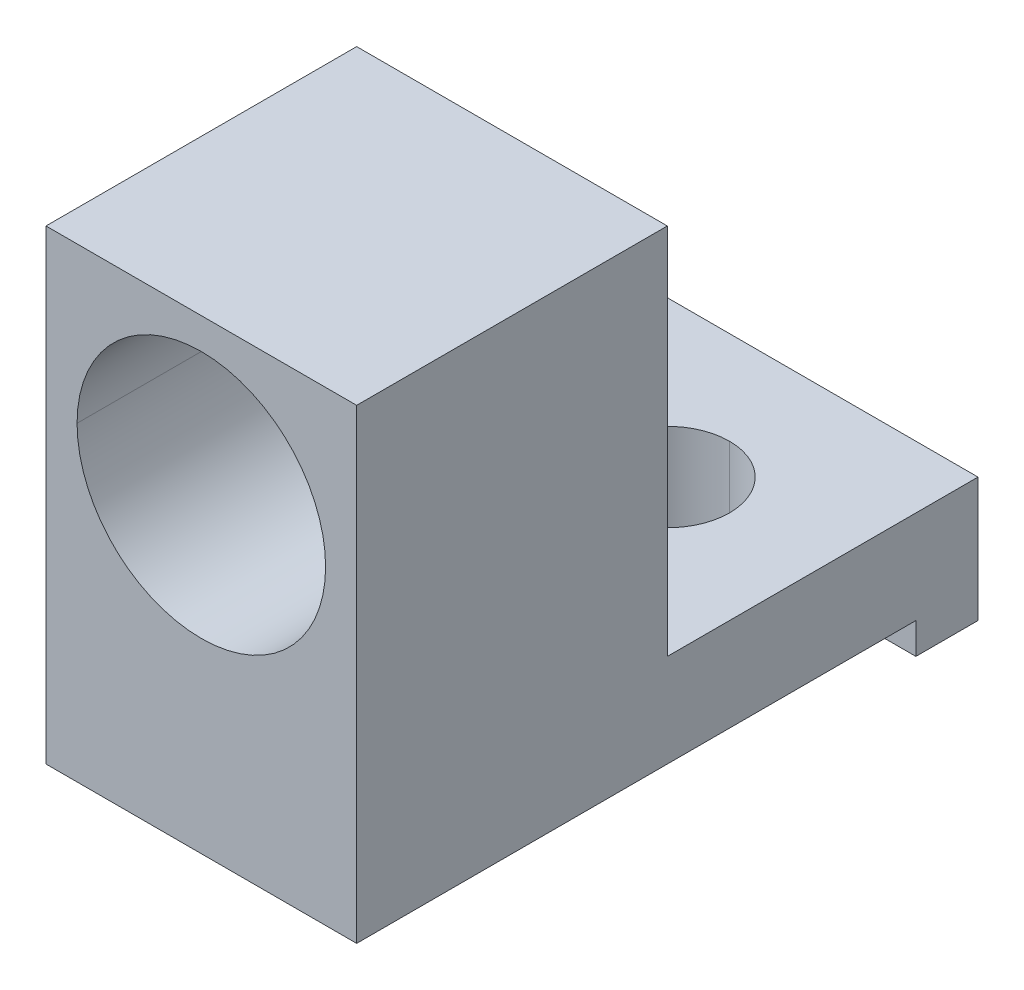
ISO-10303-21;
HEADER;
FILE_DESCRIPTION(('STEP AP214'),'2;1');
FILE_NAME('part.step','',(''),(''),'','','');
FILE_SCHEMA(('AUTOMOTIVE_DESIGN { 1 0 10303 214 1 1 1 1 }'));
ENDSEC;
DATA;
#1=APPLICATION_CONTEXT('core data for automotive mechanical design processes');
#2=APPLICATION_PROTOCOL_DEFINITION('international standard','automotive_design',2000,#1);
#3=PRODUCT_CONTEXT('',#1,'mechanical');
#4=PRODUCT('Part','Part','',(#3));
#5=PRODUCT_RELATED_PRODUCT_CATEGORY('part','',(#4));
#6=PRODUCT_DEFINITION_FORMATION('','',#4);
#7=PRODUCT_DEFINITION_CONTEXT('part definition',#1,'design');
#8=PRODUCT_DEFINITION('design','',#6,#7);
#9=PRODUCT_DEFINITION_SHAPE('','',#8);
#10=(LENGTH_UNIT() NAMED_UNIT(*) SI_UNIT(.MILLI.,.METRE.));
#11=(NAMED_UNIT(*) PLANE_ANGLE_UNIT() SI_UNIT($,.RADIAN.));
#12=(NAMED_UNIT(*) SI_UNIT($,.STERADIAN.) SOLID_ANGLE_UNIT());
#13=UNCERTAINTY_MEASURE_WITH_UNIT(LENGTH_MEASURE(1.E-05),#10,'distance_accuracy_value','');
#14=(GEOMETRIC_REPRESENTATION_CONTEXT(3) GLOBAL_UNCERTAINTY_ASSIGNED_CONTEXT((#13)) GLOBAL_UNIT_ASSIGNED_CONTEXT((#10,
#11,#12)) REPRESENTATION_CONTEXT('',''));
#15=CARTESIAN_POINT('',(0.,0.,0.));
#16=DIRECTION('',(0.,0.,1.));
#17=DIRECTION('',(1.,0.,0.));
#18=AXIS2_PLACEMENT_3D('',#15,#16,#17);
#19=CARTESIAN_POINT('',(5.,5.,-20.));
#20=DIRECTION('',(1.,0.,0.));
#21=DIRECTION('',(0.,1.,0.));
#22=AXIS2_PLACEMENT_3D('',#19,#20,#21);
#23=PLANE('',#22);
#24=DIRECTION('',(0.,1.,0.));
#25=VECTOR('',#24,1.);
#26=CARTESIAN_POINT('',(5.,-10.,-18.));
#27=LINE('',#26,#25);
#28=CARTESIAN_POINT('',(5.,-11.,-18.));
#29=VERTEX_POINT('',#28);
#30=CARTESIAN_POINT('',(5.,-10.,-18.));
#31=VERTEX_POINT('',#30);
#32=EDGE_CURVE('E175',#29,#31,#27,.T.);
#33=ORIENTED_EDGE('',*,*,#32,.F.);
#34=DIRECTION('',(0.,0.,1.));
#35=VECTOR('',#34,1.);
#36=CARTESIAN_POINT('',(5.,-11.,-18.));
#37=LINE('',#36,#35);
#38=CARTESIAN_POINT('',(5.,-11.,-20.));
#39=VERTEX_POINT('',#38);
#40=EDGE_CURVE('E42',#39,#29,#37,.T.);
#41=ORIENTED_EDGE('',*,*,#40,.F.);
#42=DIRECTION('',(0.,1.,0.));
#43=VECTOR('',#42,1.);
#44=CARTESIAN_POINT('',(5.,5.,-20.));
#45=LINE('',#44,#43);
#46=CARTESIAN_POINT('',(5.,-7.,-20.));
#47=VERTEX_POINT('',#46);
#48=EDGE_CURVE('E11',#39,#47,#45,.T.);
#49=ORIENTED_EDGE('',*,*,#48,.T.);
#50=DIRECTION('',(0.,0.,-1.));
#51=VECTOR('',#50,1.);
#52=CARTESIAN_POINT('',(5.,-7.,-20.));
#53=LINE('',#52,#51);
#54=CARTESIAN_POINT('',(5.,-7.,-10.));
#55=VERTEX_POINT('',#54);
#56=EDGE_CURVE('E231',#55,#47,#53,.T.);
#57=ORIENTED_EDGE('',*,*,#56,.F.);
#58=DIRECTION('',(0.,-1.,0.));
#59=VECTOR('',#58,1.);
#60=CARTESIAN_POINT('',(5.,5.,-10.));
#61=LINE('',#60,#59);
#62=CARTESIAN_POINT('',(5.,5.,-10.));
#63=VERTEX_POINT('',#62);
#64=EDGE_CURVE('E255',#63,#55,#61,.T.);
#65=ORIENTED_EDGE('',*,*,#64,.F.);
#66=DIRECTION('',(0.,0.,1.));
#67=VECTOR('',#66,1.);
#68=CARTESIAN_POINT('',(5.,5.,-20.));
#69=LINE('',#68,#67);
#70=CARTESIAN_POINT('',(5.,5.,0.));
#71=VERTEX_POINT('',#70);
#72=EDGE_CURVE('E27',#63,#71,#69,.T.);
#73=ORIENTED_EDGE('',*,*,#72,.T.);
#74=DIRECTION('',(0.,1.,0.));
#75=VECTOR('',#74,1.);
#76=CARTESIAN_POINT('',(5.,5.,0.));
#77=LINE('',#76,#75);
#78=CARTESIAN_POINT('',(5.,-10.,0.));
#79=VERTEX_POINT('',#78);
#80=EDGE_CURVE('E208',#79,#71,#77,.T.);
#81=ORIENTED_EDGE('',*,*,#80,.F.);
#82=DIRECTION('',(0.,0.,1.));
#83=VECTOR('',#82,1.);
#84=CARTESIAN_POINT('',(5.,-10.,0.));
#85=LINE('',#84,#83);
#86=EDGE_CURVE('E226',#31,#79,#85,.T.);
#87=ORIENTED_EDGE('',*,*,#86,.F.);
#88=EDGE_LOOP('',(#33,#41,#49,#57,#65,#73,#81,#87));
#89=FACE_BOUND('',#88,.T.);
#90=ADVANCED_FACE('F16',(#89),#23,.T.);
#91=CARTESIAN_POINT('',(-5.,5.,-20.));
#92=DIRECTION('',(-1.,0.,0.));
#93=DIRECTION('',(0.,1.,0.));
#94=AXIS2_PLACEMENT_3D('',#91,#92,#93);
#95=PLANE('',#94);
#96=DIRECTION('',(0.,-1.,0.));
#97=VECTOR('',#96,1.);
#98=CARTESIAN_POINT('',(-5.,5.,-20.));
#99=LINE('',#98,#97);
#100=CARTESIAN_POINT('',(-5.,-7.,-20.));
#101=VERTEX_POINT('',#100);
#102=CARTESIAN_POINT('',(-5.,-11.,-20.));
#103=VERTEX_POINT('',#102);
#104=EDGE_CURVE('E236',#101,#103,#99,.T.);
#105=ORIENTED_EDGE('',*,*,#104,.T.);
#106=DIRECTION('',(0.,0.,-1.));
#107=VECTOR('',#106,1.);
#108=CARTESIAN_POINT('',(-5.,-11.,-18.));
#109=LINE('',#108,#107);
#110=CARTESIAN_POINT('',(-5.,-11.,-18.));
#111=VERTEX_POINT('',#110);
#112=EDGE_CURVE('E180',#111,#103,#109,.T.);
#113=ORIENTED_EDGE('',*,*,#112,.F.);
#114=DIRECTION('',(0.,1.,0.));
#115=VECTOR('',#114,1.);
#116=CARTESIAN_POINT('',(-5.,-10.,-18.));
#117=LINE('',#116,#115);
#118=CARTESIAN_POINT('',(-5.,-10.,-18.));
#119=VERTEX_POINT('',#118);
#120=EDGE_CURVE('E240',#111,#119,#117,.T.);
#121=ORIENTED_EDGE('',*,*,#120,.T.);
#122=DIRECTION('',(0.,0.,1.));
#123=VECTOR('',#122,1.);
#124=CARTESIAN_POINT('',(-5.,-10.,0.));
#125=LINE('',#124,#123);
#126=CARTESIAN_POINT('',(-5.,-10.,0.));
#127=VERTEX_POINT('',#126);
#128=EDGE_CURVE('E221',#119,#127,#125,.T.);
#129=ORIENTED_EDGE('',*,*,#128,.T.);
#130=DIRECTION('',(0.,-1.,0.));
#131=VECTOR('',#130,1.);
#132=CARTESIAN_POINT('',(-5.,5.,0.));
#133=LINE('',#132,#131);
#134=CARTESIAN_POINT('',(-5.,5.,0.));
#135=VERTEX_POINT('',#134);
#136=EDGE_CURVE('E209',#135,#127,#133,.T.);
#137=ORIENTED_EDGE('',*,*,#136,.F.);
#138=DIRECTION('',(0.,0.,1.));
#139=VECTOR('',#138,1.);
#140=CARTESIAN_POINT('',(-5.,5.,-20.));
#141=LINE('',#140,#139);
#142=CARTESIAN_POINT('',(-5.,5.,-10.));
#143=VERTEX_POINT('',#142);
#144=EDGE_CURVE('E193',#143,#135,#141,.T.);
#145=ORIENTED_EDGE('',*,*,#144,.F.);
#146=DIRECTION('',(0.,-1.,0.));
#147=VECTOR('',#146,1.);
#148=CARTESIAN_POINT('',(-5.,5.,-10.));
#149=LINE('',#148,#147);
#150=CARTESIAN_POINT('',(-5.,-7.,-10.));
#151=VERTEX_POINT('',#150);
#152=EDGE_CURVE('E217',#143,#151,#149,.T.);
#153=ORIENTED_EDGE('',*,*,#152,.T.);
#154=DIRECTION('',(0.,0.,-1.));
#155=VECTOR('',#154,1.);
#156=CARTESIAN_POINT('',(-5.,-7.,-20.));
#157=LINE('',#156,#155);
#158=EDGE_CURVE('E222',#151,#101,#157,.T.);
#159=ORIENTED_EDGE('',*,*,#158,.T.);
#160=EDGE_LOOP('',(#105,#113,#121,#129,#137,#145,#153,#159));
#161=FACE_BOUND('',#160,.T.);
#162=ADVANCED_FACE('F286',(#161),#95,.T.);
#163=CARTESIAN_POINT('',(0.,0.,-20.));
#164=DIRECTION('',(0.,0.,1.));
#165=DIRECTION('',(1.,0.,0.));
#166=AXIS2_PLACEMENT_3D('',#163,#164,#165);
#167=PLANE('',#166);
#168=DIRECTION('',(1.,0.,0.));
#169=VECTOR('',#168,1.);
#170=CARTESIAN_POINT('',(-5.,-11.,-20.));
#171=LINE('',#170,#169);
#172=EDGE_CURVE('E189',#103,#39,#171,.T.);
#173=ORIENTED_EDGE('',*,*,#172,.F.);
#174=ORIENTED_EDGE('',*,*,#104,.F.);
#175=DIRECTION('',(1.,0.,0.));
#176=VECTOR('',#175,1.);
#177=CARTESIAN_POINT('',(-5.,-7.,-20.));
#178=LINE('',#177,#176);
#179=EDGE_CURVE('E244',#101,#47,#178,.T.);
#180=ORIENTED_EDGE('',*,*,#179,.T.);
#181=ORIENTED_EDGE('',*,*,#48,.F.);
#182=EDGE_LOOP('',(#173,#174,#180,#181));
#183=FACE_BOUND('',#182,.T.);
#184=ADVANCED_FACE('F291',(#183),#167,.F.);
#185=CARTESIAN_POINT('',(-5.,-10.,-18.));
#186=DIRECTION('',(0.,0.,-1.));
#187=DIRECTION('',(0.,-1.,0.));
#188=AXIS2_PLACEMENT_3D('',#185,#186,#187);
#189=PLANE('',#188);
#190=DIRECTION('',(-1.,0.,0.));
#191=VECTOR('',#190,1.);
#192=CARTESIAN_POINT('',(-5.,-11.,-18.));
#193=LINE('',#192,#191);
#194=EDGE_CURVE('E216',#29,#111,#193,.T.);
#195=ORIENTED_EDGE('',*,*,#194,.F.);
#196=ORIENTED_EDGE('',*,*,#32,.T.);
#197=DIRECTION('',(1.,0.,0.));
#198=VECTOR('',#197,1.);
#199=CARTESIAN_POINT('',(-5.,-10.,-18.));
#200=LINE('',#199,#198);
#201=EDGE_CURVE('E250',#119,#31,#200,.T.);
#202=ORIENTED_EDGE('',*,*,#201,.F.);
#203=ORIENTED_EDGE('',*,*,#120,.F.);
#204=EDGE_LOOP('',(#195,#196,#202,#203));
#205=FACE_BOUND('',#204,.T.);
#206=ADVANCED_FACE('F309',(#205),#189,.F.);
#207=CARTESIAN_POINT('',(0.,-12.,-15.));
#208=DIRECTION('',(0.,1.,0.));
#209=DIRECTION('',(0.,0.,1.));
#210=AXIS2_PLACEMENT_3D('',#207,#208,#209);
#211=CYLINDRICAL_SURFACE('',#210,2.);
#212=CARTESIAN_POINT('',(0.,-10.,-15.));
#213=DIRECTION('',(0.,1.,0.));
#214=DIRECTION('',(0.,0.,1.));
#215=AXIS2_PLACEMENT_3D('',#212,#213,#214);
#216=CIRCLE('',#215,2.);
#217=CARTESIAN_POINT('',(0.,-10.,-17.));
#218=VERTEX_POINT('',#217);
#219=CARTESIAN_POINT('',(0.,-10.,-13.));
#220=VERTEX_POINT('',#219);
#221=EDGE_CURVE('E170',#218,#220,#216,.T.);
#222=ORIENTED_EDGE('',*,*,#221,.F.);
#223=DIRECTION('',(0.,1.,0.));
#224=VECTOR('',#223,1.);
#225=CARTESIAN_POINT('',(0.,-12.,-17.));
#226=LINE('',#225,#224);
#227=CARTESIAN_POINT('',(0.,-7.,-17.));
#228=VERTEX_POINT('',#227);
#229=EDGE_CURVE('E164',#218,#228,#226,.T.);
#230=ORIENTED_EDGE('',*,*,#229,.T.);
#231=CARTESIAN_POINT('',(0.,-7.,-15.));
#232=DIRECTION('',(0.,1.,0.));
#233=DIRECTION('',(0.,0.,1.));
#234=AXIS2_PLACEMENT_3D('',#231,#232,#233);
#235=CIRCLE('',#234,2.);
#236=CARTESIAN_POINT('',(0.,-7.,-13.));
#237=VERTEX_POINT('',#236);
#238=EDGE_CURVE('E157',#228,#237,#235,.T.);
#239=ORIENTED_EDGE('',*,*,#238,.T.);
#240=DIRECTION('',(0.,1.,0.));
#241=VECTOR('',#240,1.);
#242=CARTESIAN_POINT('',(0.,-12.,-13.));
#243=LINE('',#242,#241);
#244=EDGE_CURVE('E178',#220,#237,#243,.T.);
#245=ORIENTED_EDGE('',*,*,#244,.F.);
#246=EDGE_LOOP('',(#222,#230,#239,#245));
#247=FACE_BOUND('',#246,.T.);
#248=ADVANCED_FACE('F168',(#247),#211,.F.);
#249=CARTESIAN_POINT('',(0.,0.,-20.));
#250=DIRECTION('',(0.,0.,1.));
#251=DIRECTION('',(1.,0.,0.));
#252=AXIS2_PLACEMENT_3D('',#249,#250,#251);
#253=CYLINDRICAL_SURFACE('',#252,3.);
#254=CARTESIAN_POINT('',(0.,0.,-10.));
#255=DIRECTION('',(0.,0.,1.));
#256=DIRECTION('',(0.,-1.,0.));
#257=AXIS2_PLACEMENT_3D('',#254,#255,#256);
#258=CIRCLE('',#257,3.);
#259=CARTESIAN_POINT('',(-3.,0.,-10.));
#260=VERTEX_POINT('',#259);
#261=CARTESIAN_POINT('',(3.,0.,-10.));
#262=VERTEX_POINT('',#261);
#263=EDGE_CURVE('E196',#260,#262,#258,.T.);
#264=ORIENTED_EDGE('',*,*,#263,.F.);
#265=DIRECTION('',(0.,0.,1.));
#266=VECTOR('',#265,1.);
#267=CARTESIAN_POINT('',(-3.,0.,-20.));
#268=LINE('',#267,#266);
#269=CARTESIAN_POINT('',(-3.,0.,-6.));
#270=VERTEX_POINT('',#269);
#271=EDGE_CURVE('E165',#260,#270,#268,.T.);
#272=ORIENTED_EDGE('',*,*,#271,.T.);
#273=CARTESIAN_POINT('',(0.,0.,-6.));
#274=DIRECTION('',(0.,0.,1.));
#275=DIRECTION('',(1.,0.,0.));
#276=AXIS2_PLACEMENT_3D('',#273,#274,#275);
#277=CIRCLE('',#276,3.);
#278=CARTESIAN_POINT('',(3.,0.,-6.));
#279=VERTEX_POINT('',#278);
#280=EDGE_CURVE('E232',#270,#279,#277,.T.);
#281=ORIENTED_EDGE('',*,*,#280,.T.);
#282=DIRECTION('',(0.,0.,1.));
#283=VECTOR('',#282,1.);
#284=CARTESIAN_POINT('',(3.,0.,-20.));
#285=LINE('',#284,#283);
#286=EDGE_CURVE('E198',#262,#279,#285,.T.);
#287=ORIENTED_EDGE('',*,*,#286,.F.);
#288=EDGE_LOOP('',(#264,#272,#281,#287));
#289=FACE_BOUND('',#288,.T.);
#290=ADVANCED_FACE('F316',(#289),#253,.F.);
#291=CARTESIAN_POINT('',(0.,0.,-6.));
#292=DIRECTION('',(0.,0.,1.));
#293=DIRECTION('',(1.,0.,0.));
#294=AXIS2_PLACEMENT_3D('',#291,#292,#293);
#295=CYLINDRICAL_SURFACE('',#294,4.);
#296=CARTESIAN_POINT('',(0.,0.,-6.));
#297=DIRECTION('',(0.,0.,1.));
#298=DIRECTION('',(1.,0.,0.));
#299=AXIS2_PLACEMENT_3D('',#296,#297,#298);
#300=CIRCLE('',#299,4.);
#301=CARTESIAN_POINT('',(-4.,0.,-6.));
#302=VERTEX_POINT('',#301);
#303=CARTESIAN_POINT('',(4.,0.,-6.));
#304=VERTEX_POINT('',#303);
#305=EDGE_CURVE('E109',#302,#304,#300,.T.);
#306=ORIENTED_EDGE('',*,*,#305,.F.);
#307=DIRECTION('',(0.,0.,1.));
#308=VECTOR('',#307,1.);
#309=CARTESIAN_POINT('',(-4.,0.,-6.));
#310=LINE('',#309,#308);
#311=CARTESIAN_POINT('',(-4.,0.,0.));
#312=VERTEX_POINT('',#311);
#313=EDGE_CURVE('E213',#302,#312,#310,.T.);
#314=ORIENTED_EDGE('',*,*,#313,.T.);
#315=CARTESIAN_POINT('',(0.,0.,0.));
#316=DIRECTION('',(0.,0.,1.));
#317=DIRECTION('',(1.,0.,0.));
#318=AXIS2_PLACEMENT_3D('',#315,#316,#317);
#319=CIRCLE('',#318,4.);
#320=CARTESIAN_POINT('',(4.,0.,0.));
#321=VERTEX_POINT('',#320);
#322=EDGE_CURVE('E129',#312,#321,#319,.T.);
#323=ORIENTED_EDGE('',*,*,#322,.T.);
#324=DIRECTION('',(0.,0.,1.));
#325=VECTOR('',#324,1.);
#326=CARTESIAN_POINT('',(4.,0.,-6.));
#327=LINE('',#326,#325);
#328=EDGE_CURVE('E119',#304,#321,#327,.T.);
#329=ORIENTED_EDGE('',*,*,#328,.F.);
#330=EDGE_LOOP('',(#306,#314,#323,#329));
#331=FACE_BOUND('',#330,.T.);
#332=ADVANCED_FACE('F266',(#331),#295,.F.);
#333=CARTESIAN_POINT('',(-5.,5.,-20.));
#334=DIRECTION('',(0.,1.,0.));
#335=DIRECTION('',(1.,0.,0.));
#336=AXIS2_PLACEMENT_3D('',#333,#334,#335);
#337=PLANE('',#336);
#338=DIRECTION('',(1.,0.,0.));
#339=VECTOR('',#338,1.);
#340=CARTESIAN_POINT('',(-5.,5.,-10.));
#341=LINE('',#340,#339);
#342=EDGE_CURVE('E251',#143,#63,#341,.T.);
#343=ORIENTED_EDGE('',*,*,#342,.F.);
#344=ORIENTED_EDGE('',*,*,#144,.T.);
#345=DIRECTION('',(-1.,0.,0.));
#346=VECTOR('',#345,1.);
#347=CARTESIAN_POINT('',(-5.,5.,0.));
#348=LINE('',#347,#346);
#349=EDGE_CURVE('E205',#71,#135,#348,.T.);
#350=ORIENTED_EDGE('',*,*,#349,.F.);
#351=ORIENTED_EDGE('',*,*,#72,.F.);
#352=EDGE_LOOP('',(#343,#344,#350,#351));
#353=FACE_BOUND('',#352,.T.);
#354=ADVANCED_FACE('F270',(#353),#337,.T.);
#355=CARTESIAN_POINT('',(0.,0.,0.));
#356=DIRECTION('',(0.,0.,1.));
#357=DIRECTION('',(1.,0.,0.));
#358=AXIS2_PLACEMENT_3D('',#355,#356,#357);
#359=PLANE('',#358);
#360=DIRECTION('',(1.,0.,0.));
#361=VECTOR('',#360,1.);
#362=CARTESIAN_POINT('',(-5.,-10.,0.));
#363=LINE('',#362,#361);
#364=EDGE_CURVE('E353',#127,#79,#363,.T.);
#365=ORIENTED_EDGE('',*,*,#364,.T.);
#366=ORIENTED_EDGE('',*,*,#80,.T.);
#367=ORIENTED_EDGE('',*,*,#349,.T.);
#368=ORIENTED_EDGE('',*,*,#136,.T.);
#369=EDGE_LOOP('',(#365,#366,#367,#368));
#370=FACE_BOUND('',#369,.T.);
#371=CARTESIAN_POINT('',(0.,0.,0.));
#372=DIRECTION('',(0.,0.,1.));
#373=DIRECTION('',(1.,0.,0.));
#374=AXIS2_PLACEMENT_3D('',#371,#372,#373);
#375=CIRCLE('',#374,4.);
#376=EDGE_CURVE('E197',#321,#312,#375,.T.);
#377=ORIENTED_EDGE('',*,*,#376,.F.);
#378=ORIENTED_EDGE('',*,*,#322,.F.);
#379=EDGE_LOOP('',(#377,#378));
#380=FACE_BOUND('',#379,.T.);
#381=ADVANCED_FACE('F267',(#370,#380),#359,.T.);
#382=CARTESIAN_POINT('',(-5.,-10.,0.));
#383=DIRECTION('',(0.,1.,0.));
#384=DIRECTION('',(1.,0.,0.));
#385=AXIS2_PLACEMENT_3D('',#382,#383,#384);
#386=PLANE('',#385);
#387=ORIENTED_EDGE('',*,*,#364,.F.);
#388=ORIENTED_EDGE('',*,*,#128,.F.);
#389=ORIENTED_EDGE('',*,*,#201,.T.);
#390=ORIENTED_EDGE('',*,*,#86,.T.);
#391=EDGE_LOOP('',(#387,#388,#389,#390));
#392=FACE_BOUND('',#391,.T.);
#393=CARTESIAN_POINT('',(0.,-10.,-15.));
#394=DIRECTION('',(0.,1.,0.));
#395=DIRECTION('',(0.,0.,1.));
#396=AXIS2_PLACEMENT_3D('',#393,#394,#395);
#397=CIRCLE('',#396,2.);
#398=EDGE_CURVE('E223',#220,#218,#397,.T.);
#399=ORIENTED_EDGE('',*,*,#398,.T.);
#400=ORIENTED_EDGE('',*,*,#221,.T.);
#401=EDGE_LOOP('',(#399,#400));
#402=FACE_BOUND('',#401,.T.);
#403=ADVANCED_FACE('F269',(#392,#402),#386,.F.);
#404=CARTESIAN_POINT('',(-5.,-7.,-20.));
#405=DIRECTION('',(0.,-1.,0.));
#406=DIRECTION('',(0.,0.,-1.));
#407=AXIS2_PLACEMENT_3D('',#404,#405,#406);
#408=PLANE('',#407);
#409=ORIENTED_EDGE('',*,*,#179,.F.);
#410=ORIENTED_EDGE('',*,*,#158,.F.);
#411=DIRECTION('',(1.,0.,0.));
#412=VECTOR('',#411,1.);
#413=CARTESIAN_POINT('',(-5.,-7.,-10.));
#414=LINE('',#413,#412);
#415=EDGE_CURVE('E227',#151,#55,#414,.T.);
#416=ORIENTED_EDGE('',*,*,#415,.T.);
#417=ORIENTED_EDGE('',*,*,#56,.T.);
#418=EDGE_LOOP('',(#409,#410,#416,#417));
#419=FACE_BOUND('',#418,.T.);
#420=CARTESIAN_POINT('',(0.,-7.,-15.));
#421=DIRECTION('',(0.,1.,0.));
#422=DIRECTION('',(0.,0.,1.));
#423=AXIS2_PLACEMENT_3D('',#420,#421,#422);
#424=CIRCLE('',#423,2.);
#425=EDGE_CURVE('E161',#237,#228,#424,.T.);
#426=ORIENTED_EDGE('',*,*,#425,.F.);
#427=ORIENTED_EDGE('',*,*,#238,.F.);
#428=EDGE_LOOP('',(#426,#427));
#429=FACE_BOUND('',#428,.T.);
#430=ADVANCED_FACE('F159',(#419,#429),#408,.F.);
#431=CARTESIAN_POINT('',(-5.,5.,-10.));
#432=DIRECTION('',(0.,0.,1.));
#433=DIRECTION('',(1.,0.,0.));
#434=AXIS2_PLACEMENT_3D('',#431,#432,#433);
#435=PLANE('',#434);
#436=ORIENTED_EDGE('',*,*,#415,.F.);
#437=ORIENTED_EDGE('',*,*,#152,.F.);
#438=ORIENTED_EDGE('',*,*,#342,.T.);
#439=ORIENTED_EDGE('',*,*,#64,.T.);
#440=EDGE_LOOP('',(#436,#437,#438,#439));
#441=FACE_BOUND('',#440,.T.);
#442=CARTESIAN_POINT('',(0.,0.,-10.));
#443=DIRECTION('',(0.,0.,1.));
#444=DIRECTION('',(0.,-1.,0.));
#445=AXIS2_PLACEMENT_3D('',#442,#443,#444);
#446=CIRCLE('',#445,3.);
#447=EDGE_CURVE('E20',#262,#260,#446,.T.);
#448=ORIENTED_EDGE('',*,*,#447,.T.);
#449=ORIENTED_EDGE('',*,*,#263,.T.);
#450=EDGE_LOOP('',(#448,#449));
#451=FACE_BOUND('',#450,.T.);
#452=ADVANCED_FACE('F303',(#441,#451),#435,.F.);
#453=CARTESIAN_POINT('',(0.,0.,-6.));
#454=DIRECTION('',(0.,0.,1.));
#455=DIRECTION('',(1.,0.,0.));
#456=AXIS2_PLACEMENT_3D('',#453,#454,#455);
#457=CYLINDRICAL_SURFACE('',#456,4.);
#458=ORIENTED_EDGE('',*,*,#313,.F.);
#459=CARTESIAN_POINT('',(0.,0.,-6.));
#460=DIRECTION('',(0.,0.,1.));
#461=DIRECTION('',(1.,0.,0.));
#462=AXIS2_PLACEMENT_3D('',#459,#460,#461);
#463=CIRCLE('',#462,4.);
#464=EDGE_CURVE('E204',#304,#302,#463,.T.);
#465=ORIENTED_EDGE('',*,*,#464,.F.);
#466=ORIENTED_EDGE('',*,*,#328,.T.);
#467=ORIENTED_EDGE('',*,*,#376,.T.);
#468=EDGE_LOOP('',(#458,#465,#466,#467));
#469=FACE_BOUND('',#468,.T.);
#470=ADVANCED_FACE('F18',(#469),#457,.F.);
#471=CARTESIAN_POINT('',(0.,0.,-6.));
#472=DIRECTION('',(0.,0.,1.));
#473=DIRECTION('',(1.,0.,0.));
#474=AXIS2_PLACEMENT_3D('',#471,#472,#473);
#475=PLANE('',#474);
#476=ORIENTED_EDGE('',*,*,#464,.T.);
#477=ORIENTED_EDGE('',*,*,#305,.T.);
#478=EDGE_LOOP('',(#476,#477));
#479=FACE_BOUND('',#478,.T.);
#480=CARTESIAN_POINT('',(0.,0.,-6.));
#481=DIRECTION('',(0.,0.,1.));
#482=DIRECTION('',(1.,0.,0.));
#483=AXIS2_PLACEMENT_3D('',#480,#481,#482);
#484=CIRCLE('',#483,3.);
#485=EDGE_CURVE('E187',#279,#270,#484,.T.);
#486=ORIENTED_EDGE('',*,*,#485,.F.);
#487=ORIENTED_EDGE('',*,*,#280,.F.);
#488=EDGE_LOOP('',(#486,#487));
#489=FACE_BOUND('',#488,.T.);
#490=ADVANCED_FACE('F301',(#479,#489),#475,.T.);
#491=CARTESIAN_POINT('',(0.,0.,-20.));
#492=DIRECTION('',(0.,0.,1.));
#493=DIRECTION('',(1.,0.,0.));
#494=AXIS2_PLACEMENT_3D('',#491,#492,#493);
#495=CYLINDRICAL_SURFACE('',#494,3.);
#496=ORIENTED_EDGE('',*,*,#271,.F.);
#497=ORIENTED_EDGE('',*,*,#447,.F.);
#498=ORIENTED_EDGE('',*,*,#286,.T.);
#499=ORIENTED_EDGE('',*,*,#485,.T.);
#500=EDGE_LOOP('',(#496,#497,#498,#499));
#501=FACE_BOUND('',#500,.T.);
#502=ADVANCED_FACE('F298',(#501),#495,.F.);
#503=CARTESIAN_POINT('',(0.,-12.,-15.));
#504=DIRECTION('',(0.,1.,0.));
#505=DIRECTION('',(0.,0.,1.));
#506=AXIS2_PLACEMENT_3D('',#503,#504,#505);
#507=CYLINDRICAL_SURFACE('',#506,2.);
#508=ORIENTED_EDGE('',*,*,#229,.F.);
#509=ORIENTED_EDGE('',*,*,#398,.F.);
#510=ORIENTED_EDGE('',*,*,#244,.T.);
#511=ORIENTED_EDGE('',*,*,#425,.T.);
#512=EDGE_LOOP('',(#508,#509,#510,#511));
#513=FACE_BOUND('',#512,.T.);
#514=ADVANCED_FACE('F177',(#513),#507,.F.);
#515=CARTESIAN_POINT('',(0.,-11.,0.));
#516=DIRECTION('',(0.,-1.,0.));
#517=DIRECTION('',(0.,0.,-1.));
#518=AXIS2_PLACEMENT_3D('',#515,#516,#517);
#519=PLANE('',#518);
#520=ORIENTED_EDGE('',*,*,#112,.T.);
#521=ORIENTED_EDGE('',*,*,#172,.T.);
#522=ORIENTED_EDGE('',*,*,#40,.T.);
#523=ORIENTED_EDGE('',*,*,#194,.T.);
#524=EDGE_LOOP('',(#520,#521,#522,#523));
#525=FACE_BOUND('',#524,.T.);
#526=ADVANCED_FACE('F297',(#525),#519,.T.);
#527=CLOSED_SHELL('',(#90,#162,#184,#206,#248,#290,#332,#354,#381,#403,#430,#452,#470,#490,#502,
#514,#526));
#528=MANIFOLD_SOLID_BREP('B1',#527);
#529=ADVANCED_BREP_SHAPE_REPRESENTATION('',(#18,#528),#14);
#530=SHAPE_DEFINITION_REPRESENTATION(#9,#529);
ENDSEC;
END-ISO-10303-21;
